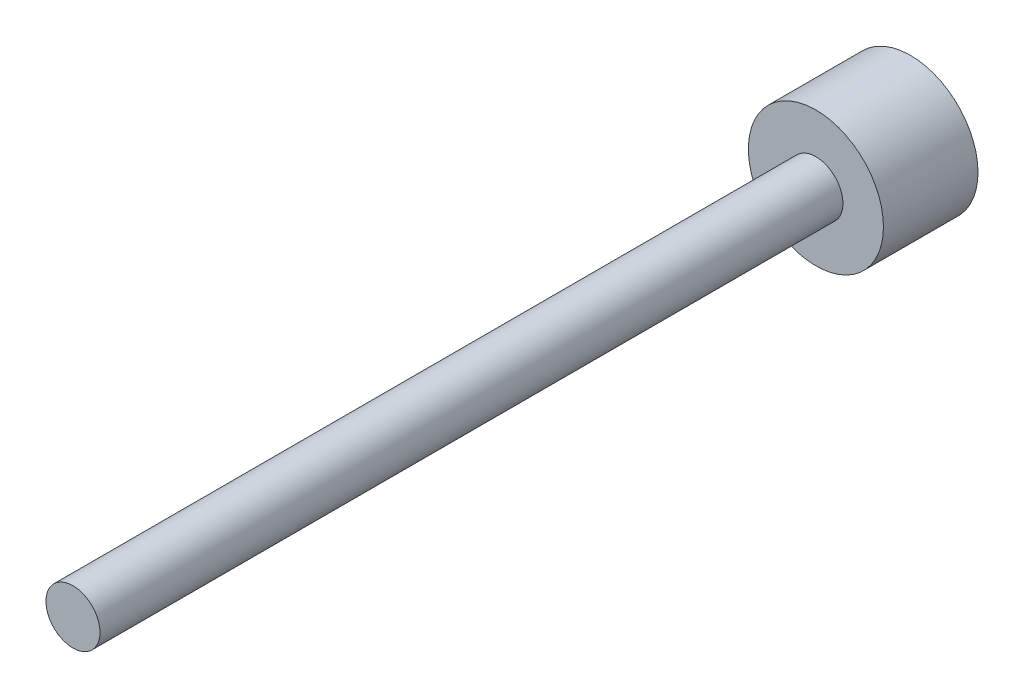
ISO-10303-21;
HEADER;
FILE_DESCRIPTION(('STEP AP214'),'2;1');
FILE_NAME('part.step','',(''),(''),'','','');
FILE_SCHEMA(('AUTOMOTIVE_DESIGN { 1 0 10303 214 1 1 1 1 }'));
ENDSEC;
DATA;
#1=APPLICATION_CONTEXT('core data for automotive mechanical design processes');
#2=APPLICATION_PROTOCOL_DEFINITION('international standard','automotive_design',2000,#1);
#3=PRODUCT_CONTEXT('',#1,'mechanical');
#4=PRODUCT('Part','Part','',(#3));
#5=PRODUCT_RELATED_PRODUCT_CATEGORY('part','',(#4));
#6=PRODUCT_DEFINITION_FORMATION('','',#4);
#7=PRODUCT_DEFINITION_CONTEXT('part definition',#1,'design');
#8=PRODUCT_DEFINITION('design','',#6,#7);
#9=PRODUCT_DEFINITION_SHAPE('','',#8);
#10=(LENGTH_UNIT() NAMED_UNIT(*) SI_UNIT(.MILLI.,.METRE.));
#11=(NAMED_UNIT(*) PLANE_ANGLE_UNIT() SI_UNIT($,.RADIAN.));
#12=(NAMED_UNIT(*) SI_UNIT($,.STERADIAN.) SOLID_ANGLE_UNIT());
#13=UNCERTAINTY_MEASURE_WITH_UNIT(LENGTH_MEASURE(1.E-05),#10,'distance_accuracy_value','');
#14=(GEOMETRIC_REPRESENTATION_CONTEXT(3) GLOBAL_UNCERTAINTY_ASSIGNED_CONTEXT((#13)) GLOBAL_UNIT_ASSIGNED_CONTEXT((#10,
#11,#12)) REPRESENTATION_CONTEXT('',''));
#15=CARTESIAN_POINT('',(0.,0.,0.));
#16=DIRECTION('',(0.,0.,1.));
#17=DIRECTION('',(1.,0.,0.));
#18=AXIS2_PLACEMENT_3D('',#15,#16,#17);
#19=CARTESIAN_POINT('',(0.,0.,8.89));
#20=DIRECTION('',(0.,0.,-1.));
#21=DIRECTION('',(-1.,0.,0.));
#22=AXIS2_PLACEMENT_3D('',#19,#20,#21);
#23=CYLINDRICAL_SURFACE('',#22,6.35);
#24=CARTESIAN_POINT('',(0.,0.,8.89));
#25=DIRECTION('',(0.,0.,1.));
#26=DIRECTION('',(1.,0.,0.));
#27=AXIS2_PLACEMENT_3D('',#24,#25,#26);
#28=CIRCLE('',#27,6.35);
#29=CARTESIAN_POINT('',(6.35,0.,8.89));
#30=VERTEX_POINT('',#29);
#31=EDGE_CURVE('E10',#30,#30,#28,.T.);
#32=ORIENTED_EDGE('',*,*,#31,.F.);
#33=EDGE_LOOP('',(#32));
#34=FACE_BOUND('',#33,.T.);
#35=CARTESIAN_POINT('',(0.,0.,0.));
#36=DIRECTION('',(0.,0.,1.));
#37=DIRECTION('',(1.,0.,0.));
#38=AXIS2_PLACEMENT_3D('',#35,#36,#37);
#39=CIRCLE('',#38,6.35);
#40=CARTESIAN_POINT('',(6.35,0.,0.));
#41=VERTEX_POINT('',#40);
#42=EDGE_CURVE('E34',#41,#41,#39,.T.);
#43=ORIENTED_EDGE('',*,*,#42,.T.);
#44=EDGE_LOOP('',(#43));
#45=FACE_BOUND('',#44,.T.);
#46=ADVANCED_FACE('F31',(#34,#45),#23,.T.);
#47=CARTESIAN_POINT('',(0.,0.,8.89));
#48=DIRECTION('',(0.,0.,1.));
#49=DIRECTION('',(1.,0.,0.));
#50=AXIS2_PLACEMENT_3D('',#47,#48,#49);
#51=PLANE('',#50);
#52=CARTESIAN_POINT('',(0.,0.,8.89));
#53=DIRECTION('',(0.,0.,1.));
#54=DIRECTION('',(1.,0.,0.));
#55=AXIS2_PLACEMENT_3D('',#52,#53,#54);
#56=CIRCLE('',#55,2.54);
#57=CARTESIAN_POINT('',(2.54,0.,8.89));
#58=VERTEX_POINT('',#57);
#59=EDGE_CURVE('E43',#58,#58,#56,.T.);
#60=ORIENTED_EDGE('',*,*,#59,.F.);
#61=EDGE_LOOP('',(#60));
#62=FACE_BOUND('',#61,.T.);
#63=ORIENTED_EDGE('',*,*,#31,.T.);
#64=EDGE_LOOP('',(#63));
#65=FACE_BOUND('',#64,.T.);
#66=ADVANCED_FACE('F58',(#62,#65),#51,.T.);
#67=CARTESIAN_POINT('',(0.,0.,0.));
#68=DIRECTION('',(0.,0.,1.));
#69=DIRECTION('',(1.,0.,0.));
#70=AXIS2_PLACEMENT_3D('',#67,#68,#69);
#71=PLANE('',#70);
#72=ORIENTED_EDGE('',*,*,#42,.F.);
#73=EDGE_LOOP('',(#72));
#74=FACE_BOUND('',#73,.T.);
#75=ADVANCED_FACE('F54',(#74),#71,.F.);
#76=CARTESIAN_POINT('',(0.,0.,78.74));
#77=DIRECTION('',(0.,0.,-1.));
#78=DIRECTION('',(-1.,0.,0.));
#79=AXIS2_PLACEMENT_3D('',#76,#77,#78);
#80=CYLINDRICAL_SURFACE('',#79,2.54);
#81=CARTESIAN_POINT('',(0.,0.,78.74));
#82=DIRECTION('',(0.,0.,1.));
#83=DIRECTION('',(1.,0.,0.));
#84=AXIS2_PLACEMENT_3D('',#81,#82,#83);
#85=CIRCLE('',#84,2.54);
#86=CARTESIAN_POINT('',(2.54,0.,78.74));
#87=VERTEX_POINT('',#86);
#88=EDGE_CURVE('E41',#87,#87,#85,.T.);
#89=ORIENTED_EDGE('',*,*,#88,.F.);
#90=EDGE_LOOP('',(#89));
#91=FACE_BOUND('',#90,.T.);
#92=ORIENTED_EDGE('',*,*,#59,.T.);
#93=EDGE_LOOP('',(#92));
#94=FACE_BOUND('',#93,.T.);
#95=ADVANCED_FACE('F51',(#91,#94),#80,.T.);
#96=CARTESIAN_POINT('',(0.,0.,78.74));
#97=DIRECTION('',(0.,0.,1.));
#98=DIRECTION('',(1.,0.,0.));
#99=AXIS2_PLACEMENT_3D('',#96,#97,#98);
#100=PLANE('',#99);
#101=ORIENTED_EDGE('',*,*,#88,.T.);
#102=EDGE_LOOP('',(#101));
#103=FACE_BOUND('',#102,.T.);
#104=ADVANCED_FACE('F49',(#103),#100,.T.);
#105=CLOSED_SHELL('',(#46,#66,#75,#95,#104));
#106=MANIFOLD_SOLID_BREP('B2',#105);
#107=ADVANCED_BREP_SHAPE_REPRESENTATION('',(#18,#106),#14);
#108=SHAPE_DEFINITION_REPRESENTATION(#9,#107);
ENDSEC;
END-ISO-10303-21;
